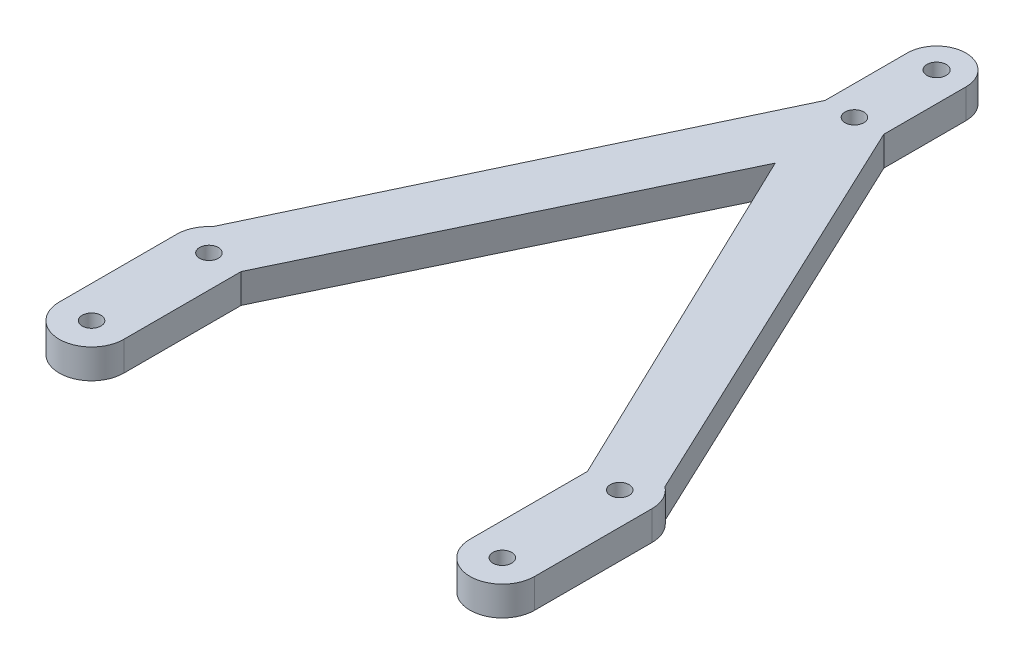
ISO-10303-21;
HEADER;
FILE_DESCRIPTION(('STEP AP214'),'2;1');
FILE_NAME('part.step','',(''),(''),'','','');
FILE_SCHEMA(('AUTOMOTIVE_DESIGN { 1 0 10303 214 1 1 1 1 }'));
ENDSEC;
DATA;
#1=APPLICATION_CONTEXT('core data for automotive mechanical design processes');
#2=APPLICATION_PROTOCOL_DEFINITION('international standard','automotive_design',2000,#1);
#3=PRODUCT_CONTEXT('',#1,'mechanical');
#4=PRODUCT('Part','Part','',(#3));
#5=PRODUCT_RELATED_PRODUCT_CATEGORY('part','',(#4));
#6=PRODUCT_DEFINITION_FORMATION('','',#4);
#7=PRODUCT_DEFINITION_CONTEXT('part definition',#1,'design');
#8=PRODUCT_DEFINITION('design','',#6,#7);
#9=PRODUCT_DEFINITION_SHAPE('','',#8);
#10=(LENGTH_UNIT() NAMED_UNIT(*) SI_UNIT(.MILLI.,.METRE.));
#11=(NAMED_UNIT(*) PLANE_ANGLE_UNIT() SI_UNIT($,.RADIAN.));
#12=(NAMED_UNIT(*) SI_UNIT($,.STERADIAN.) SOLID_ANGLE_UNIT());
#13=UNCERTAINTY_MEASURE_WITH_UNIT(LENGTH_MEASURE(1.E-05),#10,'distance_accuracy_value','');
#14=(GEOMETRIC_REPRESENTATION_CONTEXT(3) GLOBAL_UNCERTAINTY_ASSIGNED_CONTEXT((#13)) GLOBAL_UNIT_ASSIGNED_CONTEXT((#10,
#11,#12)) REPRESENTATION_CONTEXT('',''));
#15=CARTESIAN_POINT('',(0.,0.,0.));
#16=DIRECTION('',(0.,0.,1.));
#17=DIRECTION('',(1.,0.,0.));
#18=AXIS2_PLACEMENT_3D('',#15,#16,#17);
#19=CARTESIAN_POINT('',(-35.,5.,8.21149363044269));
#20=DIRECTION('',(0.,1.,0.));
#21=DIRECTION('',(0.,0.,1.));
#22=AXIS2_PLACEMENT_3D('',#19,#20,#21);
#23=PLANE('',#22);
#24=CARTESIAN_POINT('',(0.,5.,-100.788506369557));
#25=DIRECTION('',(0.,1.,0.));
#26=DIRECTION('',(0.,0.,1.));
#27=AXIS2_PLACEMENT_3D('',#24,#25,#26);
#28=CIRCLE('',#27,1.63475306682459);
#29=CARTESIAN_POINT('',(0.,5.,-99.1537533027327));
#30=VERTEX_POINT('',#29);
#31=EDGE_CURVE('E392',#30,#30,#28,.T.);
#32=ORIENTED_EDGE('',*,*,#31,.F.);
#33=EDGE_LOOP('',(#32));
#34=FACE_BOUND('',#33,.T.);
#35=CARTESIAN_POINT('',(35.,5.,-11.7885063695573));
#36=DIRECTION('',(0.,1.,0.));
#37=DIRECTION('',(0.,0.,-1.));
#38=AXIS2_PLACEMENT_3D('',#35,#36,#37);
#39=CIRCLE('',#38,1.6);
#40=CARTESIAN_POINT('',(35.,5.,-13.3885063695573));
#41=VERTEX_POINT('',#40);
#42=EDGE_CURVE('E408',#41,#41,#39,.T.);
#43=ORIENTED_EDGE('',*,*,#42,.F.);
#44=EDGE_LOOP('',(#43));
#45=FACE_BOUND('',#44,.T.);
#46=CARTESIAN_POINT('',(-35.,5.,8.21149363044269));
#47=DIRECTION('',(0.,1.,0.));
#48=DIRECTION('',(0.,0.,1.));
#49=AXIS2_PLACEMENT_3D('',#46,#47,#48);
#50=CIRCLE('',#49,1.6);
#51=CARTESIAN_POINT('',(-35.,5.,9.81149363044269));
#52=VERTEX_POINT('',#51);
#53=EDGE_CURVE('E192',#52,#52,#50,.T.);
#54=ORIENTED_EDGE('',*,*,#53,.F.);
#55=EDGE_LOOP('',(#54));
#56=FACE_BOUND('',#55,.T.);
#57=CARTESIAN_POINT('',(-35.,5.,8.21149363044269));
#58=DIRECTION('',(0.,1.,0.));
#59=DIRECTION('',(0.,0.,1.));
#60=AXIS2_PLACEMENT_3D('',#57,#58,#59);
#61=CIRCLE('',#60,5.5);
#62=CARTESIAN_POINT('',(-40.5,5.,8.21149363044269));
#63=VERTEX_POINT('',#62);
#64=CARTESIAN_POINT('',(-29.5,5.,8.21149363044269));
#65=VERTEX_POINT('',#64);
#66=EDGE_CURVE('E231',#63,#65,#61,.T.);
#67=ORIENTED_EDGE('',*,*,#66,.T.);
#68=DIRECTION('',(0.,0.,-1.));
#69=VECTOR('',#68,1.);
#70=CARTESIAN_POINT('',(-29.5,5.,-11.7885063695573));
#71=LINE('',#70,#69);
#72=CARTESIAN_POINT('',(-29.5,5.,-11.7885063695573));
#73=VERTEX_POINT('',#72);
#74=EDGE_CURVE('E125',#65,#73,#71,.T.);
#75=ORIENTED_EDGE('',*,*,#74,.T.);
#76=DIRECTION('',(0.432492743445164,0.,-0.901637414300935));
#77=VECTOR('',#76,1.);
#78=CARTESIAN_POINT('',(-29.5,5.,-11.7885063695573));
#79=LINE('',#78,#77);
#80=CARTESIAN_POINT('',(0.,5.,-73.2885063695573));
#81=VERTEX_POINT('',#80);
#82=EDGE_CURVE('E280',#73,#81,#79,.T.);
#83=ORIENTED_EDGE('',*,*,#82,.T.);
#84=DIRECTION('',(0.432492743445164,0.,0.901637414300935));
#85=VECTOR('',#84,1.);
#86=CARTESIAN_POINT('',(0.,5.,-73.2885063695573));
#87=LINE('',#86,#85);
#88=CARTESIAN_POINT('',(29.5,5.,-11.7885063695573));
#89=VERTEX_POINT('',#88);
#90=EDGE_CURVE('E300',#81,#89,#87,.T.);
#91=ORIENTED_EDGE('',*,*,#90,.T.);
#92=DIRECTION('',(0.,0.,1.));
#93=VECTOR('',#92,1.);
#94=CARTESIAN_POINT('',(29.5,5.,-11.7885063695573));
#95=LINE('',#94,#93);
#96=CARTESIAN_POINT('',(29.5,5.,8.21149363044268));
#97=VERTEX_POINT('',#96);
#98=EDGE_CURVE('E296',#89,#97,#95,.T.);
#99=ORIENTED_EDGE('',*,*,#98,.T.);
#100=CARTESIAN_POINT('',(35.,5.,8.21149363044268));
#101=DIRECTION('',(0.,1.,0.));
#102=DIRECTION('',(0.,0.,-1.));
#103=AXIS2_PLACEMENT_3D('',#100,#101,#102);
#104=CIRCLE('',#103,5.5);
#105=CARTESIAN_POINT('',(40.5,5.,8.21149363044268));
#106=VERTEX_POINT('',#105);
#107=EDGE_CURVE('E299',#97,#106,#104,.T.);
#108=ORIENTED_EDGE('',*,*,#107,.T.);
#109=DIRECTION('',(0.,0.,-1.));
#110=VECTOR('',#109,1.);
#111=CARTESIAN_POINT('',(40.5,5.,-11.7885063695573));
#112=LINE('',#111,#110);
#113=CARTESIAN_POINT('',(40.5,5.,-11.7885063695573));
#114=VERTEX_POINT('',#113);
#115=EDGE_CURVE('E304',#106,#114,#112,.T.);
#116=ORIENTED_EDGE('',*,*,#115,.T.);
#117=CARTESIAN_POINT('',(35.,5.,-11.7885063695573));
#118=DIRECTION('',(0.,1.,0.));
#119=DIRECTION('',(0.,0.,-1.));
#120=AXIS2_PLACEMENT_3D('',#117,#118,#119);
#121=CIRCLE('',#120,5.49999999999999);
#122=CARTESIAN_POINT('',(38.3480992208628,5.,-16.152017754584));
#123=VERTEX_POINT('',#122);
#124=EDGE_CURVE('E311',#114,#123,#121,.T.);
#125=ORIENTED_EDGE('',*,*,#124,.T.);
#126=DIRECTION('',(-0.426922347957018,0.,-0.904288288553416));
#127=VECTOR('',#126,1.);
#128=CARTESIAN_POINT('',(38.3480992208628,5.,-16.152017754584));
#129=LINE('',#128,#127);
#130=CARTESIAN_POINT('',(4.99999999999998,5.,-86.7885063695573));
#131=VERTEX_POINT('',#130);
#132=EDGE_CURVE('E314',#123,#131,#129,.T.);
#133=ORIENTED_EDGE('',*,*,#132,.T.);
#134=DIRECTION('',(0.,0.,-1.));
#135=VECTOR('',#134,1.);
#136=CARTESIAN_POINT('',(4.99999999999998,5.,-100.788506369557));
#137=LINE('',#136,#135);
#138=CARTESIAN_POINT('',(4.99999999999998,5.,-100.788506369557));
#139=VERTEX_POINT('',#138);
#140=EDGE_CURVE('E317',#131,#139,#137,.T.);
#141=ORIENTED_EDGE('',*,*,#140,.T.);
#142=CARTESIAN_POINT('',(0.,5.,-100.788506369557));
#143=DIRECTION('',(0.,1.,0.));
#144=DIRECTION('',(0.,0.,1.));
#145=AXIS2_PLACEMENT_3D('',#142,#143,#144);
#146=CIRCLE('',#145,4.99999999999999);
#147=CARTESIAN_POINT('',(-4.99999999999999,5.,-100.788506369557));
#148=VERTEX_POINT('',#147);
#149=EDGE_CURVE('E320',#139,#148,#146,.T.);
#150=ORIENTED_EDGE('',*,*,#149,.T.);
#151=DIRECTION('',(0.,0.,1.));
#152=VECTOR('',#151,1.);
#153=CARTESIAN_POINT('',(-5.,5.,-100.788506369557));
#154=LINE('',#153,#152);
#155=CARTESIAN_POINT('',(-5.,5.,-86.7885063695573));
#156=VERTEX_POINT('',#155);
#157=EDGE_CURVE('E165',#148,#156,#154,.T.);
#158=ORIENTED_EDGE('',*,*,#157,.T.);
#159=DIRECTION('',(-0.428246424812271,0.,0.903661994130277));
#160=VECTOR('',#159,1.);
#161=CARTESIAN_POINT('',(-5.,5.,-86.7885063695573));
#162=LINE('',#161,#160);
#163=CARTESIAN_POINT('',(-38.5529632922307,5.,-15.9868931840447));
#164=VERTEX_POINT('',#163);
#165=EDGE_CURVE('E159',#156,#164,#162,.T.);
#166=ORIENTED_EDGE('',*,*,#165,.T.);
#167=CARTESIAN_POINT('',(-35.,5.,-11.7885063695573));
#168=DIRECTION('',(0.,1.,0.));
#169=DIRECTION('',(0.,0.,1.));
#170=AXIS2_PLACEMENT_3D('',#167,#168,#169);
#171=CIRCLE('',#170,5.49999999999999);
#172=CARTESIAN_POINT('',(-40.5,5.,-11.7885063695573));
#173=VERTEX_POINT('',#172);
#174=EDGE_CURVE('E163',#164,#173,#171,.T.);
#175=ORIENTED_EDGE('',*,*,#174,.T.);
#176=DIRECTION('',(0.,0.,1.));
#177=VECTOR('',#176,1.);
#178=CARTESIAN_POINT('',(-40.5,5.,-11.7885063695573));
#179=LINE('',#178,#177);
#180=EDGE_CURVE('E61',#173,#63,#179,.T.);
#181=ORIENTED_EDGE('',*,*,#180,.T.);
#182=EDGE_LOOP('',(#67,#75,#83,#91,#99,#108,#116,#125,#133,#141,#150,#158,#166,#175,#181));
#183=FACE_BOUND('',#182,.T.);
#184=CARTESIAN_POINT('',(-35.,5.,-11.7885063695573));
#185=DIRECTION('',(0.,1.,0.));
#186=DIRECTION('',(0.,0.,1.));
#187=AXIS2_PLACEMENT_3D('',#184,#185,#186);
#188=CIRCLE('',#187,1.6);
#189=CARTESIAN_POINT('',(-35.,5.,-10.1885063695573));
#190=VERTEX_POINT('',#189);
#191=EDGE_CURVE('E416',#190,#190,#188,.T.);
#192=ORIENTED_EDGE('',*,*,#191,.F.);
#193=EDGE_LOOP('',(#192));
#194=FACE_BOUND('',#193,.T.);
#195=CARTESIAN_POINT('',(35.,5.,8.21149363044268));
#196=DIRECTION('',(0.,1.,0.));
#197=DIRECTION('',(0.,0.,-1.));
#198=AXIS2_PLACEMENT_3D('',#195,#196,#197);
#199=CIRCLE('',#198,1.6);
#200=CARTESIAN_POINT('',(35.,5.,6.61149363044269));
#201=VERTEX_POINT('',#200);
#202=EDGE_CURVE('E400',#201,#201,#199,.T.);
#203=ORIENTED_EDGE('',*,*,#202,.F.);
#204=EDGE_LOOP('',(#203));
#205=FACE_BOUND('',#204,.T.);
#206=CARTESIAN_POINT('',(0.,5.,-86.7885063695573));
#207=DIRECTION('',(0.,1.,0.));
#208=DIRECTION('',(0.,0.,1.));
#209=AXIS2_PLACEMENT_3D('',#206,#207,#208);
#210=CIRCLE('',#209,1.6);
#211=CARTESIAN_POINT('',(0.,5.,-85.1885063695573));
#212=VERTEX_POINT('',#211);
#213=EDGE_CURVE('E381',#212,#212,#210,.T.);
#214=ORIENTED_EDGE('',*,*,#213,.F.);
#215=EDGE_LOOP('',(#214));
#216=FACE_BOUND('',#215,.T.);
#217=ADVANCED_FACE('F43',(#34,#45,#56,#183,#194,#205,#216),#23,.T.);
#218=CARTESIAN_POINT('',(-35.,0.,8.21149363044269));
#219=DIRECTION('',(0.,1.,0.));
#220=DIRECTION('',(0.,0.,1.));
#221=AXIS2_PLACEMENT_3D('',#218,#219,#220);
#222=PLANE('',#221);
#223=CARTESIAN_POINT('',(-35.,0.,8.21149363044269));
#224=DIRECTION('',(0.,1.,0.));
#225=DIRECTION('',(0.,0.,1.));
#226=AXIS2_PLACEMENT_3D('',#223,#224,#225);
#227=CIRCLE('',#226,5.5);
#228=CARTESIAN_POINT('',(-40.5,0.,8.21149363044269));
#229=VERTEX_POINT('',#228);
#230=CARTESIAN_POINT('',(-29.5,0.,8.21149363044269));
#231=VERTEX_POINT('',#230);
#232=EDGE_CURVE('E187',#229,#231,#227,.T.);
#233=ORIENTED_EDGE('',*,*,#232,.F.);
#234=DIRECTION('',(0.,0.,1.));
#235=VECTOR('',#234,1.);
#236=CARTESIAN_POINT('',(-40.5,0.,-11.7885063695573));
#237=LINE('',#236,#235);
#238=CARTESIAN_POINT('',(-40.5,0.,-11.7885063695573));
#239=VERTEX_POINT('',#238);
#240=EDGE_CURVE('E117',#239,#229,#237,.T.);
#241=ORIENTED_EDGE('',*,*,#240,.F.);
#242=CARTESIAN_POINT('',(-35.,0.,-11.7885063695573));
#243=DIRECTION('',(0.,1.,0.));
#244=DIRECTION('',(0.,0.,1.));
#245=AXIS2_PLACEMENT_3D('',#242,#243,#244);
#246=CIRCLE('',#245,5.49999999999999);
#247=CARTESIAN_POINT('',(-38.5529632922307,0.,-15.9868931840447));
#248=VERTEX_POINT('',#247);
#249=EDGE_CURVE('E111',#248,#239,#246,.T.);
#250=ORIENTED_EDGE('',*,*,#249,.F.);
#251=DIRECTION('',(-0.428246424812271,0.,0.903661994130277));
#252=VECTOR('',#251,1.);
#253=CARTESIAN_POINT('',(-5.,0.,-86.7885063695573));
#254=LINE('',#253,#252);
#255=CARTESIAN_POINT('',(-5.,0.,-86.7885063695573));
#256=VERTEX_POINT('',#255);
#257=EDGE_CURVE('E174',#256,#248,#254,.T.);
#258=ORIENTED_EDGE('',*,*,#257,.F.);
#259=DIRECTION('',(0.,0.,1.));
#260=VECTOR('',#259,1.);
#261=CARTESIAN_POINT('',(-5.,0.,-100.788506369557));
#262=LINE('',#261,#260);
#263=CARTESIAN_POINT('',(-4.99999999999999,0.,-100.788506369557));
#264=VERTEX_POINT('',#263);
#265=EDGE_CURVE('E222',#264,#256,#262,.T.);
#266=ORIENTED_EDGE('',*,*,#265,.F.);
#267=CARTESIAN_POINT('',(0.,0.,-100.788506369557));
#268=DIRECTION('',(0.,1.,0.));
#269=DIRECTION('',(0.,0.,1.));
#270=AXIS2_PLACEMENT_3D('',#267,#268,#269);
#271=CIRCLE('',#270,4.99999999999999);
#272=CARTESIAN_POINT('',(4.99999999999998,0.,-100.788506369557));
#273=VERTEX_POINT('',#272);
#274=EDGE_CURVE('E219',#273,#264,#271,.T.);
#275=ORIENTED_EDGE('',*,*,#274,.F.);
#276=DIRECTION('',(0.,0.,-1.));
#277=VECTOR('',#276,1.);
#278=CARTESIAN_POINT('',(4.99999999999998,0.,-100.788506369557));
#279=LINE('',#278,#277);
#280=CARTESIAN_POINT('',(4.99999999999998,0.,-86.7885063695573));
#281=VERTEX_POINT('',#280);
#282=EDGE_CURVE('E216',#281,#273,#279,.T.);
#283=ORIENTED_EDGE('',*,*,#282,.F.);
#284=DIRECTION('',(-0.426922347957018,0.,-0.904288288553416));
#285=VECTOR('',#284,1.);
#286=CARTESIAN_POINT('',(38.3480992208628,0.,-16.152017754584));
#287=LINE('',#286,#285);
#288=CARTESIAN_POINT('',(38.3480992208628,0.,-16.152017754584));
#289=VERTEX_POINT('',#288);
#290=EDGE_CURVE('E213',#289,#281,#287,.T.);
#291=ORIENTED_EDGE('',*,*,#290,.F.);
#292=CARTESIAN_POINT('',(35.,0.,-11.7885063695573));
#293=DIRECTION('',(0.,1.,0.));
#294=DIRECTION('',(0.,0.,-1.));
#295=AXIS2_PLACEMENT_3D('',#292,#293,#294);
#296=CIRCLE('',#295,5.49999999999999);
#297=CARTESIAN_POINT('',(40.5,0.,-11.7885063695573));
#298=VERTEX_POINT('',#297);
#299=EDGE_CURVE('E210',#298,#289,#296,.T.);
#300=ORIENTED_EDGE('',*,*,#299,.F.);
#301=DIRECTION('',(0.,0.,-1.));
#302=VECTOR('',#301,1.);
#303=CARTESIAN_POINT('',(40.5,0.,-11.7885063695573));
#304=LINE('',#303,#302);
#305=CARTESIAN_POINT('',(40.5,0.,8.21149363044268));
#306=VERTEX_POINT('',#305);
#307=EDGE_CURVE('E207',#306,#298,#304,.T.);
#308=ORIENTED_EDGE('',*,*,#307,.F.);
#309=CARTESIAN_POINT('',(35.,0.,8.21149363044268));
#310=DIRECTION('',(0.,1.,0.));
#311=DIRECTION('',(0.,0.,-1.));
#312=AXIS2_PLACEMENT_3D('',#309,#310,#311);
#313=CIRCLE('',#312,5.5);
#314=CARTESIAN_POINT('',(29.5,0.,8.21149363044268));
#315=VERTEX_POINT('',#314);
#316=EDGE_CURVE('E204',#315,#306,#313,.T.);
#317=ORIENTED_EDGE('',*,*,#316,.F.);
#318=DIRECTION('',(0.,0.,1.));
#319=VECTOR('',#318,1.);
#320=CARTESIAN_POINT('',(29.5,0.,-11.7885063695573));
#321=LINE('',#320,#319);
#322=CARTESIAN_POINT('',(29.5,0.,-11.7885063695573));
#323=VERTEX_POINT('',#322);
#324=EDGE_CURVE('E201',#323,#315,#321,.T.);
#325=ORIENTED_EDGE('',*,*,#324,.F.);
#326=DIRECTION('',(0.432492743445164,0.,0.901637414300935));
#327=VECTOR('',#326,1.);
#328=CARTESIAN_POINT('',(0.,0.,-73.2885063695573));
#329=LINE('',#328,#327);
#330=CARTESIAN_POINT('',(0.,0.,-73.2885063695573));
#331=VERTEX_POINT('',#330);
#332=EDGE_CURVE('E198',#331,#323,#329,.T.);
#333=ORIENTED_EDGE('',*,*,#332,.F.);
#334=DIRECTION('',(0.432492743445164,0.,-0.901637414300935));
#335=VECTOR('',#334,1.);
#336=CARTESIAN_POINT('',(-29.5,0.,-11.7885063695573));
#337=LINE('',#336,#335);
#338=CARTESIAN_POINT('',(-29.5,0.,-11.7885063695573));
#339=VERTEX_POINT('',#338);
#340=EDGE_CURVE('E195',#339,#331,#337,.T.);
#341=ORIENTED_EDGE('',*,*,#340,.F.);
#342=DIRECTION('',(0.,0.,-1.));
#343=VECTOR('',#342,1.);
#344=CARTESIAN_POINT('',(-29.5,0.,-11.7885063695573));
#345=LINE('',#344,#343);
#346=EDGE_CURVE('E191',#231,#339,#345,.T.);
#347=ORIENTED_EDGE('',*,*,#346,.F.);
#348=EDGE_LOOP('',(#233,#241,#250,#258,#266,#275,#283,#291,#300,#308,#317,#325,#333,#341,#347));
#349=FACE_BOUND('',#348,.T.);
#350=CARTESIAN_POINT('',(-35.,0.,8.21149363044269));
#351=DIRECTION('',(0.,1.,0.));
#352=DIRECTION('',(0.,0.,1.));
#353=AXIS2_PLACEMENT_3D('',#350,#351,#352);
#354=CIRCLE('',#353,1.6);
#355=CARTESIAN_POINT('',(-35.,0.,9.81149363044269));
#356=VERTEX_POINT('',#355);
#357=EDGE_CURVE('E420',#356,#356,#354,.T.);
#358=ORIENTED_EDGE('',*,*,#357,.T.);
#359=EDGE_LOOP('',(#358));
#360=FACE_BOUND('',#359,.T.);
#361=CARTESIAN_POINT('',(-35.,0.,-11.7885063695573));
#362=DIRECTION('',(0.,1.,0.));
#363=DIRECTION('',(0.,0.,1.));
#364=AXIS2_PLACEMENT_3D('',#361,#362,#363);
#365=CIRCLE('',#364,1.6);
#366=CARTESIAN_POINT('',(-35.,0.,-10.1885063695573));
#367=VERTEX_POINT('',#366);
#368=EDGE_CURVE('E412',#367,#367,#365,.T.);
#369=ORIENTED_EDGE('',*,*,#368,.T.);
#370=EDGE_LOOP('',(#369));
#371=FACE_BOUND('',#370,.T.);
#372=CARTESIAN_POINT('',(35.,0.,-11.7885063695573));
#373=DIRECTION('',(0.,1.,0.));
#374=DIRECTION('',(0.,0.,-1.));
#375=AXIS2_PLACEMENT_3D('',#372,#373,#374);
#376=CIRCLE('',#375,1.6);
#377=CARTESIAN_POINT('',(35.,0.,-13.3885063695573));
#378=VERTEX_POINT('',#377);
#379=EDGE_CURVE('E404',#378,#378,#376,.T.);
#380=ORIENTED_EDGE('',*,*,#379,.T.);
#381=EDGE_LOOP('',(#380));
#382=FACE_BOUND('',#381,.T.);
#383=CARTESIAN_POINT('',(35.,0.,8.21149363044268));
#384=DIRECTION('',(0.,1.,0.));
#385=DIRECTION('',(0.,0.,-1.));
#386=AXIS2_PLACEMENT_3D('',#383,#384,#385);
#387=CIRCLE('',#386,1.6);
#388=CARTESIAN_POINT('',(35.,0.,6.61149363044269));
#389=VERTEX_POINT('',#388);
#390=EDGE_CURVE('E396',#389,#389,#387,.T.);
#391=ORIENTED_EDGE('',*,*,#390,.T.);
#392=EDGE_LOOP('',(#391));
#393=FACE_BOUND('',#392,.T.);
#394=CARTESIAN_POINT('',(0.,0.,-100.788506369557));
#395=DIRECTION('',(0.,1.,0.));
#396=DIRECTION('',(0.,0.,1.));
#397=AXIS2_PLACEMENT_3D('',#394,#395,#396);
#398=CIRCLE('',#397,1.63475306682459);
#399=CARTESIAN_POINT('',(0.,0.,-99.1537533027327));
#400=VERTEX_POINT('',#399);
#401=EDGE_CURVE('E389',#400,#400,#398,.T.);
#402=ORIENTED_EDGE('',*,*,#401,.T.);
#403=EDGE_LOOP('',(#402));
#404=FACE_BOUND('',#403,.T.);
#405=CARTESIAN_POINT('',(0.,0.,-86.7885063695573));
#406=DIRECTION('',(0.,1.,0.));
#407=DIRECTION('',(0.,0.,1.));
#408=AXIS2_PLACEMENT_3D('',#405,#406,#407);
#409=CIRCLE('',#408,1.6);
#410=CARTESIAN_POINT('',(0.,0.,-85.1885063695573));
#411=VERTEX_POINT('',#410);
#412=EDGE_CURVE('E384',#411,#411,#409,.T.);
#413=ORIENTED_EDGE('',*,*,#412,.T.);
#414=EDGE_LOOP('',(#413));
#415=FACE_BOUND('',#414,.T.);
#416=ADVANCED_FACE('F284',(#349,#360,#371,#382,#393,#404,#415),#222,.F.);
#417=CARTESIAN_POINT('',(-35.,5.,8.21149363044269));
#418=DIRECTION('',(0.,-1.,0.));
#419=DIRECTION('',(0.,0.,-1.));
#420=AXIS2_PLACEMENT_3D('',#417,#418,#419);
#421=CYLINDRICAL_SURFACE('',#420,5.5);
#422=ORIENTED_EDGE('',*,*,#232,.T.);
#423=DIRECTION('',(0.,-1.,0.));
#424=VECTOR('',#423,1.);
#425=CARTESIAN_POINT('',(-29.5,5.,8.21149363044269));
#426=LINE('',#425,#424);
#427=EDGE_CURVE('E11',#65,#231,#426,.T.);
#428=ORIENTED_EDGE('',*,*,#427,.F.);
#429=ORIENTED_EDGE('',*,*,#66,.F.);
#430=DIRECTION('',(0.,-1.,0.));
#431=VECTOR('',#430,1.);
#432=CARTESIAN_POINT('',(-40.5,5.,8.21149363044269));
#433=LINE('',#432,#431);
#434=EDGE_CURVE('E183',#63,#229,#433,.T.);
#435=ORIENTED_EDGE('',*,*,#434,.T.);
#436=EDGE_LOOP('',(#422,#428,#429,#435));
#437=FACE_BOUND('',#436,.T.);
#438=ADVANCED_FACE('F45',(#437),#421,.T.);
#439=CARTESIAN_POINT('',(-29.5,5.,-11.7885063695573));
#440=DIRECTION('',(-1.,0.,0.));
#441=DIRECTION('',(0.,0.,1.));
#442=AXIS2_PLACEMENT_3D('',#439,#440,#441);
#443=PLANE('',#442);
#444=ORIENTED_EDGE('',*,*,#346,.T.);
#445=DIRECTION('',(0.,-1.,0.));
#446=VECTOR('',#445,1.);
#447=CARTESIAN_POINT('',(-29.5,5.,-11.7885063695573));
#448=LINE('',#447,#446);
#449=EDGE_CURVE('E53',#73,#339,#448,.T.);
#450=ORIENTED_EDGE('',*,*,#449,.F.);
#451=ORIENTED_EDGE('',*,*,#74,.F.);
#452=ORIENTED_EDGE('',*,*,#427,.T.);
#453=EDGE_LOOP('',(#444,#450,#451,#452));
#454=FACE_BOUND('',#453,.T.);
#455=ADVANCED_FACE('F597',(#454),#443,.F.);
#456=CARTESIAN_POINT('',(-29.5,5.,-11.7885063695573));
#457=DIRECTION('',(-0.901637414300935,0.,-0.432492743445164));
#458=DIRECTION('',(-0.432492743445164,0.,0.901637414300935));
#459=AXIS2_PLACEMENT_3D('',#456,#457,#458);
#460=PLANE('',#459);
#461=ORIENTED_EDGE('',*,*,#340,.T.);
#462=DIRECTION('',(0.,-1.,0.));
#463=VECTOR('',#462,1.);
#464=CARTESIAN_POINT('',(0.,5.,-73.2885063695573));
#465=LINE('',#464,#463);
#466=EDGE_CURVE('E270',#81,#331,#465,.T.);
#467=ORIENTED_EDGE('',*,*,#466,.F.);
#468=ORIENTED_EDGE('',*,*,#82,.F.);
#469=ORIENTED_EDGE('',*,*,#449,.T.);
#470=EDGE_LOOP('',(#461,#467,#468,#469));
#471=FACE_BOUND('',#470,.T.);
#472=ADVANCED_FACE('F278',(#471),#460,.F.);
#473=CARTESIAN_POINT('',(0.,5.,-73.2885063695573));
#474=DIRECTION('',(0.901637414300935,0.,-0.432492743445164));
#475=DIRECTION('',(-0.432492743445164,0.,-0.901637414300935));
#476=AXIS2_PLACEMENT_3D('',#473,#474,#475);
#477=PLANE('',#476);
#478=ORIENTED_EDGE('',*,*,#332,.T.);
#479=DIRECTION('',(0.,-1.,0.));
#480=VECTOR('',#479,1.);
#481=CARTESIAN_POINT('',(29.5,5.,-11.7885063695573));
#482=LINE('',#481,#480);
#483=EDGE_CURVE('E266',#89,#323,#482,.T.);
#484=ORIENTED_EDGE('',*,*,#483,.F.);
#485=ORIENTED_EDGE('',*,*,#90,.F.);
#486=ORIENTED_EDGE('',*,*,#466,.T.);
#487=EDGE_LOOP('',(#478,#484,#485,#486));
#488=FACE_BOUND('',#487,.T.);
#489=ADVANCED_FACE('F290',(#488),#477,.F.);
#490=CARTESIAN_POINT('',(29.5,5.,-11.7885063695573));
#491=DIRECTION('',(1.,0.,0.));
#492=DIRECTION('',(0.,0.,-1.));
#493=AXIS2_PLACEMENT_3D('',#490,#491,#492);
#494=PLANE('',#493);
#495=ORIENTED_EDGE('',*,*,#324,.T.);
#496=DIRECTION('',(0.,-1.,0.));
#497=VECTOR('',#496,1.);
#498=CARTESIAN_POINT('',(29.5,5.,8.21149363044268));
#499=LINE('',#498,#497);
#500=EDGE_CURVE('E262',#97,#315,#499,.T.);
#501=ORIENTED_EDGE('',*,*,#500,.F.);
#502=ORIENTED_EDGE('',*,*,#98,.F.);
#503=ORIENTED_EDGE('',*,*,#483,.T.);
#504=EDGE_LOOP('',(#495,#501,#502,#503));
#505=FACE_BOUND('',#504,.T.);
#506=ADVANCED_FACE('F294',(#505),#494,.F.);
#507=CARTESIAN_POINT('',(35.,5.,8.21149363044268));
#508=DIRECTION('',(0.,-1.,0.));
#509=DIRECTION('',(0.,0.,-1.));
#510=AXIS2_PLACEMENT_3D('',#507,#508,#509);
#511=CYLINDRICAL_SURFACE('',#510,5.5);
#512=ORIENTED_EDGE('',*,*,#316,.T.);
#513=DIRECTION('',(0.,-1.,0.));
#514=VECTOR('',#513,1.);
#515=CARTESIAN_POINT('',(40.5,5.,8.21149363044268));
#516=LINE('',#515,#514);
#517=EDGE_CURVE('E258',#106,#306,#516,.T.);
#518=ORIENTED_EDGE('',*,*,#517,.F.);
#519=ORIENTED_EDGE('',*,*,#107,.F.);
#520=ORIENTED_EDGE('',*,*,#500,.T.);
#521=EDGE_LOOP('',(#512,#518,#519,#520));
#522=FACE_BOUND('',#521,.T.);
#523=ADVANCED_FACE('F558',(#522),#511,.T.);
#524=CARTESIAN_POINT('',(40.5,5.,-11.7885063695573));
#525=DIRECTION('',(-1.,0.,0.));
#526=DIRECTION('',(0.,0.,1.));
#527=AXIS2_PLACEMENT_3D('',#524,#525,#526);
#528=PLANE('',#527);
#529=ORIENTED_EDGE('',*,*,#307,.T.);
#530=DIRECTION('',(0.,-1.,0.));
#531=VECTOR('',#530,1.);
#532=CARTESIAN_POINT('',(40.5,5.,-11.7885063695573));
#533=LINE('',#532,#531);
#534=EDGE_CURVE('E254',#114,#298,#533,.T.);
#535=ORIENTED_EDGE('',*,*,#534,.F.);
#536=ORIENTED_EDGE('',*,*,#115,.F.);
#537=ORIENTED_EDGE('',*,*,#517,.T.);
#538=EDGE_LOOP('',(#529,#535,#536,#537));
#539=FACE_BOUND('',#538,.T.);
#540=ADVANCED_FACE('F547',(#539),#528,.F.);
#541=CARTESIAN_POINT('',(35.,5.,-11.7885063695573));
#542=DIRECTION('',(0.,-1.,0.));
#543=DIRECTION('',(0.,0.,-1.));
#544=AXIS2_PLACEMENT_3D('',#541,#542,#543);
#545=CYLINDRICAL_SURFACE('',#544,5.49999999999999);
#546=ORIENTED_EDGE('',*,*,#299,.T.);
#547=DIRECTION('',(0.,-1.,0.));
#548=VECTOR('',#547,1.);
#549=CARTESIAN_POINT('',(38.3480992208628,5.,-16.152017754584));
#550=LINE('',#549,#548);
#551=EDGE_CURVE('E250',#123,#289,#550,.T.);
#552=ORIENTED_EDGE('',*,*,#551,.F.);
#553=ORIENTED_EDGE('',*,*,#124,.F.);
#554=ORIENTED_EDGE('',*,*,#534,.T.);
#555=EDGE_LOOP('',(#546,#552,#553,#554));
#556=FACE_BOUND('',#555,.T.);
#557=ADVANCED_FACE('F536',(#556),#545,.T.);
#558=CARTESIAN_POINT('',(38.3480992208628,5.,-16.152017754584));
#559=DIRECTION('',(-0.904288288553416,0.,0.426922347957018));
#560=DIRECTION('',(0.426922347957018,0.,0.904288288553416));
#561=AXIS2_PLACEMENT_3D('',#558,#559,#560);
#562=PLANE('',#561);
#563=ORIENTED_EDGE('',*,*,#290,.T.);
#564=DIRECTION('',(0.,-1.,0.));
#565=VECTOR('',#564,1.);
#566=CARTESIAN_POINT('',(4.99999999999998,5.,-86.7885063695573));
#567=LINE('',#566,#565);
#568=EDGE_CURVE('E246',#131,#281,#567,.T.);
#569=ORIENTED_EDGE('',*,*,#568,.F.);
#570=ORIENTED_EDGE('',*,*,#132,.F.);
#571=ORIENTED_EDGE('',*,*,#551,.T.);
#572=EDGE_LOOP('',(#563,#569,#570,#571));
#573=FACE_BOUND('',#572,.T.);
#574=ADVANCED_FACE('F525',(#573),#562,.F.);
#575=CARTESIAN_POINT('',(4.99999999999998,5.,-100.788506369557));
#576=DIRECTION('',(-1.,0.,0.));
#577=DIRECTION('',(0.,0.,1.));
#578=AXIS2_PLACEMENT_3D('',#575,#576,#577);
#579=PLANE('',#578);
#580=ORIENTED_EDGE('',*,*,#282,.T.);
#581=DIRECTION('',(0.,-1.,0.));
#582=VECTOR('',#581,1.);
#583=CARTESIAN_POINT('',(4.99999999999998,5.,-100.788506369557));
#584=LINE('',#583,#582);
#585=EDGE_CURVE('E242',#139,#273,#584,.T.);
#586=ORIENTED_EDGE('',*,*,#585,.F.);
#587=ORIENTED_EDGE('',*,*,#140,.F.);
#588=ORIENTED_EDGE('',*,*,#568,.T.);
#589=EDGE_LOOP('',(#580,#586,#587,#588));
#590=FACE_BOUND('',#589,.T.);
#591=ADVANCED_FACE('F515',(#590),#579,.F.);
#592=CARTESIAN_POINT('',(0.,5.,-100.788506369557));
#593=DIRECTION('',(0.,-1.,0.));
#594=DIRECTION('',(0.,0.,-1.));
#595=AXIS2_PLACEMENT_3D('',#592,#593,#594);
#596=CYLINDRICAL_SURFACE('',#595,4.99999999999999);
#597=ORIENTED_EDGE('',*,*,#274,.T.);
#598=DIRECTION('',(0.,-1.,0.));
#599=VECTOR('',#598,1.);
#600=CARTESIAN_POINT('',(-4.99999999999999,5.,-100.788506369557));
#601=LINE('',#600,#599);
#602=EDGE_CURVE('E238',#148,#264,#601,.T.);
#603=ORIENTED_EDGE('',*,*,#602,.F.);
#604=ORIENTED_EDGE('',*,*,#149,.F.);
#605=ORIENTED_EDGE('',*,*,#585,.T.);
#606=EDGE_LOOP('',(#597,#603,#604,#605));
#607=FACE_BOUND('',#606,.T.);
#608=ADVANCED_FACE('F328',(#607),#596,.T.);
#609=CARTESIAN_POINT('',(-5.,5.,-100.788506369557));
#610=DIRECTION('',(1.,0.,0.));
#611=DIRECTION('',(0.,0.,-1.));
#612=AXIS2_PLACEMENT_3D('',#609,#610,#611);
#613=PLANE('',#612);
#614=ORIENTED_EDGE('',*,*,#265,.T.);
#615=DIRECTION('',(0.,-1.,0.));
#616=VECTOR('',#615,1.);
#617=CARTESIAN_POINT('',(-5.,5.,-86.7885063695573));
#618=LINE('',#617,#616);
#619=EDGE_CURVE('E176',#156,#256,#618,.T.);
#620=ORIENTED_EDGE('',*,*,#619,.F.);
#621=ORIENTED_EDGE('',*,*,#157,.F.);
#622=ORIENTED_EDGE('',*,*,#602,.T.);
#623=EDGE_LOOP('',(#614,#620,#621,#622));
#624=FACE_BOUND('',#623,.T.);
#625=ADVANCED_FACE('F332',(#624),#613,.F.);
#626=CARTESIAN_POINT('',(-5.,5.,-86.7885063695573));
#627=DIRECTION('',(0.903661994130277,0.,0.428246424812271));
#628=DIRECTION('',(0.428246424812271,0.,-0.903661994130277));
#629=AXIS2_PLACEMENT_3D('',#626,#627,#628);
#630=PLANE('',#629);
#631=ORIENTED_EDGE('',*,*,#257,.T.);
#632=DIRECTION('',(0.,-1.,0.));
#633=VECTOR('',#632,1.);
#634=CARTESIAN_POINT('',(-38.5529632922307,5.,-15.9868931840447));
#635=LINE('',#634,#633);
#636=EDGE_CURVE('E171',#164,#248,#635,.T.);
#637=ORIENTED_EDGE('',*,*,#636,.F.);
#638=ORIENTED_EDGE('',*,*,#165,.F.);
#639=ORIENTED_EDGE('',*,*,#619,.T.);
#640=EDGE_LOOP('',(#631,#637,#638,#639));
#641=FACE_BOUND('',#640,.T.);
#642=ADVANCED_FACE('F172',(#641),#630,.F.);
#643=CARTESIAN_POINT('',(-35.,5.,-11.7885063695573));
#644=DIRECTION('',(0.,-1.,0.));
#645=DIRECTION('',(0.,0.,-1.));
#646=AXIS2_PLACEMENT_3D('',#643,#644,#645);
#647=CYLINDRICAL_SURFACE('',#646,5.49999999999999);
#648=ORIENTED_EDGE('',*,*,#249,.T.);
#649=DIRECTION('',(0.,-1.,0.));
#650=VECTOR('',#649,1.);
#651=CARTESIAN_POINT('',(-40.5,5.,-11.7885063695573));
#652=LINE('',#651,#650);
#653=EDGE_CURVE('E177',#173,#239,#652,.T.);
#654=ORIENTED_EDGE('',*,*,#653,.F.);
#655=ORIENTED_EDGE('',*,*,#174,.F.);
#656=ORIENTED_EDGE('',*,*,#636,.T.);
#657=EDGE_LOOP('',(#648,#654,#655,#656));
#658=FACE_BOUND('',#657,.T.);
#659=ADVANCED_FACE('F179',(#658),#647,.T.);
#660=CARTESIAN_POINT('',(-40.5,5.,-11.7885063695573));
#661=DIRECTION('',(1.,0.,0.));
#662=DIRECTION('',(0.,0.,-1.));
#663=AXIS2_PLACEMENT_3D('',#660,#661,#662);
#664=PLANE('',#663);
#665=ORIENTED_EDGE('',*,*,#240,.T.);
#666=ORIENTED_EDGE('',*,*,#434,.F.);
#667=ORIENTED_EDGE('',*,*,#180,.F.);
#668=ORIENTED_EDGE('',*,*,#653,.T.);
#669=EDGE_LOOP('',(#665,#666,#667,#668));
#670=FACE_BOUND('',#669,.T.);
#671=ADVANCED_FACE('F336',(#670),#664,.F.);
#672=CARTESIAN_POINT('',(-35.,5.,8.21149363044269));
#673=DIRECTION('',(0.,-1.,0.));
#674=DIRECTION('',(0.,0.,-1.));
#675=AXIS2_PLACEMENT_3D('',#672,#673,#674);
#676=CYLINDRICAL_SURFACE('',#675,1.6);
#677=ORIENTED_EDGE('',*,*,#53,.T.);
#678=EDGE_LOOP('',(#677));
#679=FACE_BOUND('',#678,.T.);
#680=ORIENTED_EDGE('',*,*,#357,.F.);
#681=EDGE_LOOP('',(#680));
#682=FACE_BOUND('',#681,.T.);
#683=ADVANCED_FACE('F338',(#679,#682),#676,.F.);
#684=CARTESIAN_POINT('',(-35.,5.,-11.7885063695573));
#685=DIRECTION('',(0.,-1.,0.));
#686=DIRECTION('',(0.,0.,-1.));
#687=AXIS2_PLACEMENT_3D('',#684,#685,#686);
#688=CYLINDRICAL_SURFACE('',#687,1.6);
#689=ORIENTED_EDGE('',*,*,#191,.T.);
#690=EDGE_LOOP('',(#689));
#691=FACE_BOUND('',#690,.T.);
#692=ORIENTED_EDGE('',*,*,#368,.F.);
#693=EDGE_LOOP('',(#692));
#694=FACE_BOUND('',#693,.T.);
#695=ADVANCED_FACE('F344',(#691,#694),#688,.F.);
#696=CARTESIAN_POINT('',(35.,5.,-11.7885063695573));
#697=DIRECTION('',(0.,-1.,0.));
#698=DIRECTION('',(0.,0.,-1.));
#699=AXIS2_PLACEMENT_3D('',#696,#697,#698);
#700=CYLINDRICAL_SURFACE('',#699,1.6);
#701=ORIENTED_EDGE('',*,*,#42,.T.);
#702=EDGE_LOOP('',(#701));
#703=FACE_BOUND('',#702,.T.);
#704=ORIENTED_EDGE('',*,*,#379,.F.);
#705=EDGE_LOOP('',(#704));
#706=FACE_BOUND('',#705,.T.);
#707=ADVANCED_FACE('F360',(#703,#706),#700,.F.);
#708=CARTESIAN_POINT('',(35.,5.,8.21149363044268));
#709=DIRECTION('',(0.,-1.,0.));
#710=DIRECTION('',(0.,0.,-1.));
#711=AXIS2_PLACEMENT_3D('',#708,#709,#710);
#712=CYLINDRICAL_SURFACE('',#711,1.6);
#713=ORIENTED_EDGE('',*,*,#202,.T.);
#714=EDGE_LOOP('',(#713));
#715=FACE_BOUND('',#714,.T.);
#716=ORIENTED_EDGE('',*,*,#390,.F.);
#717=EDGE_LOOP('',(#716));
#718=FACE_BOUND('',#717,.T.);
#719=ADVANCED_FACE('F364',(#715,#718),#712,.F.);
#720=CARTESIAN_POINT('',(0.,5.,-100.788506369557));
#721=DIRECTION('',(0.,-1.,0.));
#722=DIRECTION('',(0.,0.,-1.));
#723=AXIS2_PLACEMENT_3D('',#720,#721,#722);
#724=CYLINDRICAL_SURFACE('',#723,1.63475306682459);
#725=ORIENTED_EDGE('',*,*,#31,.T.);
#726=EDGE_LOOP('',(#725));
#727=FACE_BOUND('',#726,.T.);
#728=ORIENTED_EDGE('',*,*,#401,.F.);
#729=EDGE_LOOP('',(#728));
#730=FACE_BOUND('',#729,.T.);
#731=ADVANCED_FACE('F368',(#727,#730),#724,.F.);
#732=CARTESIAN_POINT('',(0.,5.,-86.7885063695573));
#733=DIRECTION('',(0.,-1.,0.));
#734=DIRECTION('',(0.,0.,-1.));
#735=AXIS2_PLACEMENT_3D('',#732,#733,#734);
#736=CYLINDRICAL_SURFACE('',#735,1.6);
#737=ORIENTED_EDGE('',*,*,#213,.T.);
#738=EDGE_LOOP('',(#737));
#739=FACE_BOUND('',#738,.T.);
#740=ORIENTED_EDGE('',*,*,#412,.F.);
#741=EDGE_LOOP('',(#740));
#742=FACE_BOUND('',#741,.T.);
#743=ADVANCED_FACE('F372',(#739,#742),#736,.F.);
#744=CLOSED_SHELL('',(#217,#416,#438,#455,#472,#489,#506,#523,#540,#557,#574,#591,#608,#625,
#642,#659,#671,#683,#695,#707,#719,#731,#743));
#745=MANIFOLD_SOLID_BREP('B2',#744);
#746=ADVANCED_BREP_SHAPE_REPRESENTATION('',(#18,#745),#14);
#747=SHAPE_DEFINITION_REPRESENTATION(#9,#746);
ENDSEC;
END-ISO-10303-21;
